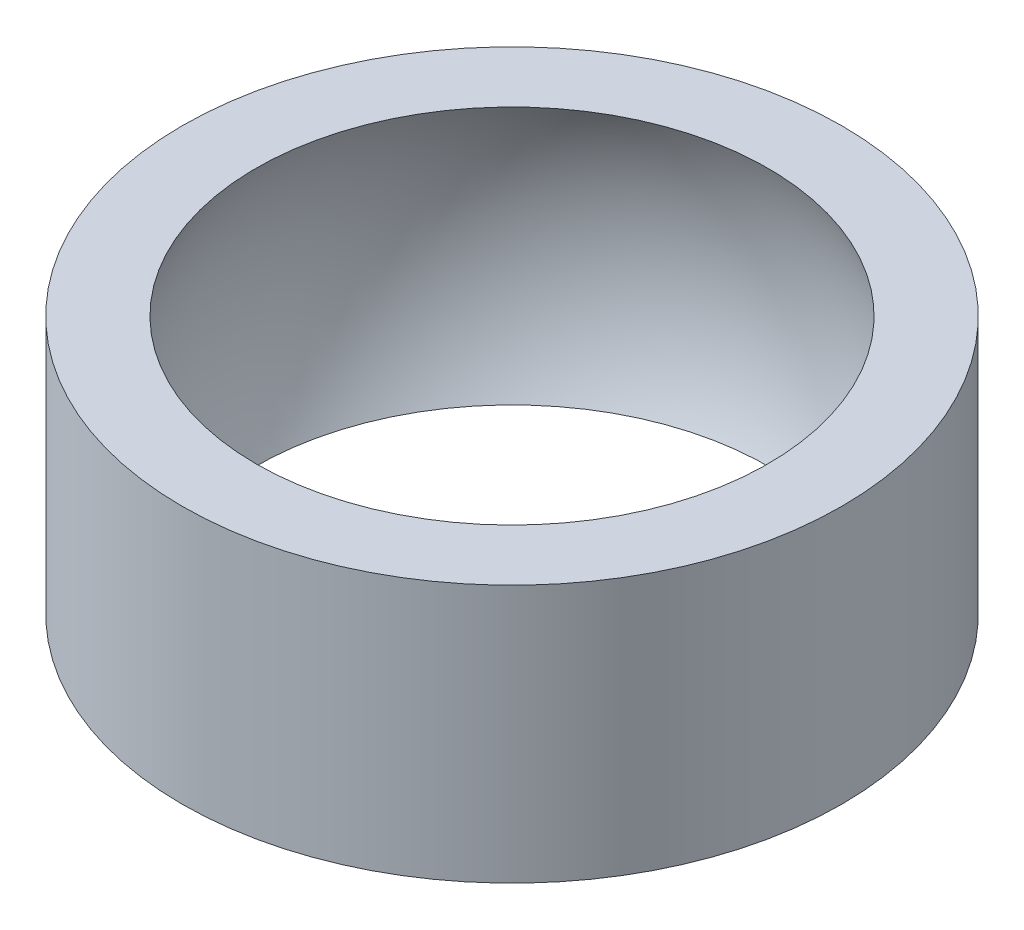
ISO-10303-21;
HEADER;
FILE_DESCRIPTION(('STEP AP214'),'2;1');
FILE_NAME('part.step','',(''),(''),'','','');
FILE_SCHEMA(('AUTOMOTIVE_DESIGN { 1 0 10303 214 1 1 1 1 }'));
ENDSEC;
DATA;
#1=APPLICATION_CONTEXT('core data for automotive mechanical design processes');
#2=APPLICATION_PROTOCOL_DEFINITION('international standard','automotive_design',2000,#1);
#3=PRODUCT_CONTEXT('',#1,'mechanical');
#4=PRODUCT('Part','Part','',(#3));
#5=PRODUCT_RELATED_PRODUCT_CATEGORY('part','',(#4));
#6=PRODUCT_DEFINITION_FORMATION('','',#4);
#7=PRODUCT_DEFINITION_CONTEXT('part definition',#1,'design');
#8=PRODUCT_DEFINITION('design','',#6,#7);
#9=PRODUCT_DEFINITION_SHAPE('','',#8);
#10=(LENGTH_UNIT() NAMED_UNIT(*) SI_UNIT(.MILLI.,.METRE.));
#11=(NAMED_UNIT(*) PLANE_ANGLE_UNIT() SI_UNIT($,.RADIAN.));
#12=(NAMED_UNIT(*) SI_UNIT($,.STERADIAN.) SOLID_ANGLE_UNIT());
#13=UNCERTAINTY_MEASURE_WITH_UNIT(LENGTH_MEASURE(1.E-05),#10,'distance_accuracy_value','');
#14=(GEOMETRIC_REPRESENTATION_CONTEXT(3) GLOBAL_UNCERTAINTY_ASSIGNED_CONTEXT((#13)) GLOBAL_UNIT_ASSIGNED_CONTEXT((#10,
#11,#12)) REPRESENTATION_CONTEXT('',''));
#15=CARTESIAN_POINT('',(0.,0.,0.));
#16=DIRECTION('',(0.,0.,1.));
#17=DIRECTION('',(1.,0.,0.));
#18=AXIS2_PLACEMENT_3D('',#15,#16,#17);
#19=CARTESIAN_POINT('',(0.,9.,0.));
#20=DIRECTION('',(0.,1.,0.));
#21=DIRECTION('',(0.,0.,1.));
#22=AXIS2_PLACEMENT_3D('',#19,#20,#21);
#23=PLANE('',#22);
#24=CARTESIAN_POINT('',(0.,9.,0.));
#25=DIRECTION('',(0.,1.,0.));
#26=DIRECTION('',(0.,0.,1.));
#27=AXIS2_PLACEMENT_3D('',#24,#25,#26);
#28=CIRCLE('',#27,8.93028554974588);
#29=CARTESIAN_POINT('',(0.,9.,8.93028554974588));
#30=VERTEX_POINT('',#29);
#31=EDGE_CURVE('E47',#30,#30,#28,.T.);
#32=ORIENTED_EDGE('',*,*,#31,.F.);
#33=EDGE_LOOP('',(#32));
#34=FACE_BOUND('',#33,.T.);
#35=CARTESIAN_POINT('',(0.,9.,0.));
#36=DIRECTION('',(0.,1.,0.));
#37=DIRECTION('',(0.,0.,1.));
#38=AXIS2_PLACEMENT_3D('',#35,#36,#37);
#39=CIRCLE('',#38,11.5);
#40=CARTESIAN_POINT('',(0.,9.,11.5));
#41=VERTEX_POINT('',#40);
#42=EDGE_CURVE('E10',#41,#41,#39,.T.);
#43=ORIENTED_EDGE('',*,*,#42,.T.);
#44=EDGE_LOOP('',(#43));
#45=FACE_BOUND('',#44,.T.);
#46=ADVANCED_FACE('F34',(#34,#45),#23,.T.);
#47=CARTESIAN_POINT('',(0.,0.,0.));
#48=DIRECTION('',(0.,1.,0.));
#49=DIRECTION('',(0.,0.,1.));
#50=AXIS2_PLACEMENT_3D('',#47,#48,#49);
#51=PLANE('',#50);
#52=CARTESIAN_POINT('',(0.,0.,0.));
#53=DIRECTION('',(0.,1.,0.));
#54=DIRECTION('',(0.,0.,1.));
#55=AXIS2_PLACEMENT_3D('',#52,#53,#54);
#56=CIRCLE('',#55,8.93028554974588);
#57=CARTESIAN_POINT('',(0.,0.,8.93028554974588));
#58=VERTEX_POINT('',#57);
#59=EDGE_CURVE('E38',#58,#58,#56,.T.);
#60=ORIENTED_EDGE('',*,*,#59,.T.);
#61=EDGE_LOOP('',(#60));
#62=FACE_BOUND('',#61,.T.);
#63=CARTESIAN_POINT('',(0.,0.,0.));
#64=DIRECTION('',(0.,1.,0.));
#65=DIRECTION('',(0.,0.,1.));
#66=AXIS2_PLACEMENT_3D('',#63,#64,#65);
#67=CIRCLE('',#66,11.5);
#68=CARTESIAN_POINT('',(0.,0.,11.5));
#69=VERTEX_POINT('',#68);
#70=EDGE_CURVE('E42',#69,#69,#67,.T.);
#71=ORIENTED_EDGE('',*,*,#70,.F.);
#72=EDGE_LOOP('',(#71));
#73=FACE_BOUND('',#72,.T.);
#74=ADVANCED_FACE('F55',(#62,#73),#51,.F.);
#75=CARTESIAN_POINT('',(0.,9.,0.));
#76=DIRECTION('',(0.,-1.,0.));
#77=DIRECTION('',(0.,0.,-1.));
#78=AXIS2_PLACEMENT_3D('',#75,#76,#77);
#79=CYLINDRICAL_SURFACE('',#78,11.5);
#80=ORIENTED_EDGE('',*,*,#42,.F.);
#81=EDGE_LOOP('',(#80));
#82=FACE_BOUND('',#81,.T.);
#83=ORIENTED_EDGE('',*,*,#70,.T.);
#84=EDGE_LOOP('',(#83));
#85=FACE_BOUND('',#84,.T.);
#86=ADVANCED_FACE('F36',(#82,#85),#79,.T.);
#87=CARTESIAN_POINT('',(0.,4.5,0.));
#88=DIRECTION('',(0.,-1.,0.));
#89=DIRECTION('',(-1.,0.,0.));
#90=AXIS2_PLACEMENT_3D('',#87,#88,#89);
#91=SPHERICAL_SURFACE('',#90,10.);
#92=ORIENTED_EDGE('',*,*,#31,.T.);
#93=EDGE_LOOP('',(#92));
#94=FACE_BOUND('',#93,.T.);
#95=ORIENTED_EDGE('',*,*,#59,.F.);
#96=EDGE_LOOP('',(#95));
#97=FACE_BOUND('',#96,.T.);
#98=ADVANCED_FACE('F58',(#94,#97),#91,.F.);
#99=CLOSED_SHELL('',(#46,#74,#86,#98));
#100=MANIFOLD_SOLID_BREP('B2',#99);
#101=ADVANCED_BREP_SHAPE_REPRESENTATION('',(#18,#100),#14);
#102=SHAPE_DEFINITION_REPRESENTATION(#9,#101);
ENDSEC;
END-ISO-10303-21;
